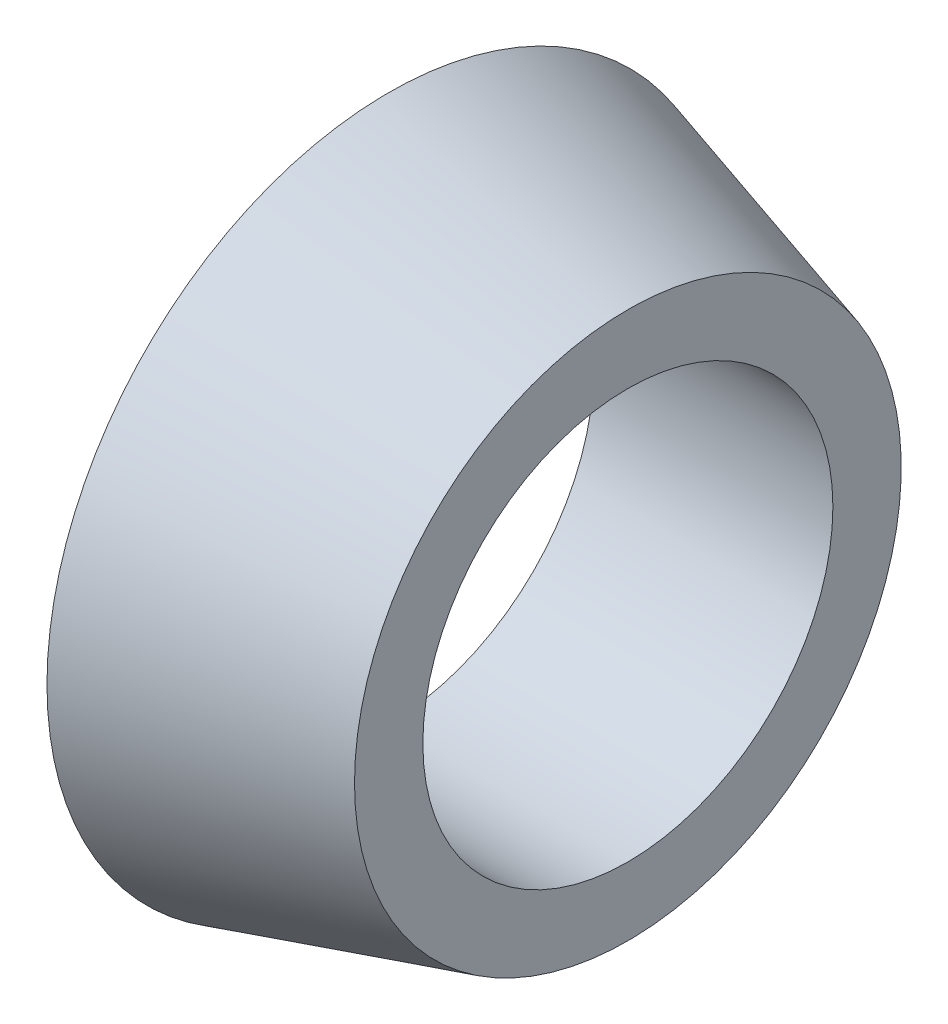
ISO-10303-21;
HEADER;
FILE_DESCRIPTION(('STEP AP214'),'2;1');
FILE_NAME('part.step','',(''),(''),'','','');
FILE_SCHEMA(('AUTOMOTIVE_DESIGN { 1 0 10303 214 1 1 1 1 }'));
ENDSEC;
DATA;
#1=APPLICATION_CONTEXT('core data for automotive mechanical design processes');
#2=APPLICATION_PROTOCOL_DEFINITION('international standard','automotive_design',2000,#1);
#3=PRODUCT_CONTEXT('',#1,'mechanical');
#4=PRODUCT('Part','Part','',(#3));
#5=PRODUCT_RELATED_PRODUCT_CATEGORY('part','',(#4));
#6=PRODUCT_DEFINITION_FORMATION('','',#4);
#7=PRODUCT_DEFINITION_CONTEXT('part definition',#1,'design');
#8=PRODUCT_DEFINITION('design','',#6,#7);
#9=PRODUCT_DEFINITION_SHAPE('','',#8);
#10=(LENGTH_UNIT() NAMED_UNIT(*) SI_UNIT(.MILLI.,.METRE.));
#11=(NAMED_UNIT(*) PLANE_ANGLE_UNIT() SI_UNIT($,.RADIAN.));
#12=(NAMED_UNIT(*) SI_UNIT($,.STERADIAN.) SOLID_ANGLE_UNIT());
#13=UNCERTAINTY_MEASURE_WITH_UNIT(LENGTH_MEASURE(1.E-05),#10,'distance_accuracy_value','');
#14=(GEOMETRIC_REPRESENTATION_CONTEXT(3) GLOBAL_UNCERTAINTY_ASSIGNED_CONTEXT((#13)) GLOBAL_UNIT_ASSIGNED_CONTEXT((#10,
#11,#12)) REPRESENTATION_CONTEXT('',''));
#15=CARTESIAN_POINT('',(0.,0.,0.));
#16=DIRECTION('',(0.,0.,1.));
#17=DIRECTION('',(1.,0.,0.));
#18=AXIS2_PLACEMENT_3D('',#15,#16,#17);
#19=CARTESIAN_POINT('',(0.,0.,0.));
#20=DIRECTION('',(-1.,0.,0.));
#21=DIRECTION('',(0.,0.,1.));
#22=AXIS2_PLACEMENT_3D('',#19,#20,#21);
#23=CYLINDRICAL_SURFACE('',#22,6.);
#24=CARTESIAN_POINT('',(7.,0.,0.));
#25=DIRECTION('',(-1.,0.,0.));
#26=DIRECTION('',(0.,0.,1.));
#27=AXIS2_PLACEMENT_3D('',#24,#25,#26);
#28=CIRCLE('',#27,6.);
#29=CARTESIAN_POINT('',(7.,0.,6.));
#30=VERTEX_POINT('',#29);
#31=EDGE_CURVE('E46',#30,#30,#28,.T.);
#32=ORIENTED_EDGE('',*,*,#31,.F.);
#33=EDGE_LOOP('',(#32));
#34=FACE_BOUND('',#33,.T.);
#35=CARTESIAN_POINT('',(0.,0.,0.));
#36=DIRECTION('',(-1.,0.,0.));
#37=DIRECTION('',(0.,0.,1.));
#38=AXIS2_PLACEMENT_3D('',#35,#36,#37);
#39=CIRCLE('',#38,6.);
#40=CARTESIAN_POINT('',(0.,0.,6.));
#41=VERTEX_POINT('',#40);
#42=EDGE_CURVE('E10',#41,#41,#39,.T.);
#43=ORIENTED_EDGE('',*,*,#42,.T.);
#44=EDGE_LOOP('',(#43));
#45=FACE_BOUND('',#44,.T.);
#46=ADVANCED_FACE('F32',(#34,#45),#23,.F.);
#47=CARTESIAN_POINT('',(0.,6.,0.));
#48=DIRECTION('',(1.,0.,0.));
#49=DIRECTION('',(0.,0.,-1.));
#50=AXIS2_PLACEMENT_3D('',#47,#48,#49);
#51=PLANE('',#50);
#52=ORIENTED_EDGE('',*,*,#42,.F.);
#53=EDGE_LOOP('',(#52));
#54=FACE_BOUND('',#53,.T.);
#55=CARTESIAN_POINT('',(0.,0.,0.));
#56=DIRECTION('',(-1.,0.,0.));
#57=DIRECTION('',(0.,0.,1.));
#58=AXIS2_PLACEMENT_3D('',#55,#56,#57);
#59=CIRCLE('',#58,10.);
#60=CARTESIAN_POINT('',(0.,0.,10.));
#61=VERTEX_POINT('',#60);
#62=EDGE_CURVE('E38',#61,#61,#59,.T.);
#63=ORIENTED_EDGE('',*,*,#62,.T.);
#64=EDGE_LOOP('',(#63));
#65=FACE_BOUND('',#64,.T.);
#66=ADVANCED_FACE('F55',(#54,#65),#51,.F.);
#67=CARTESIAN_POINT('',(7.,0.,0.));
#68=DIRECTION('',(-1.,0.,0.));
#69=DIRECTION('',(0.,0.,1.));
#70=AXIS2_PLACEMENT_3D('',#67,#68,#69);
#71=CONICAL_SURFACE('',#70,8.,0.278299659005111);
#72=ORIENTED_EDGE('',*,*,#62,.F.);
#73=EDGE_LOOP('',(#72));
#74=FACE_BOUND('',#73,.T.);
#75=CARTESIAN_POINT('',(7.,0.,0.));
#76=DIRECTION('',(-1.,0.,0.));
#77=DIRECTION('',(0.,0.,1.));
#78=AXIS2_PLACEMENT_3D('',#75,#76,#77);
#79=CIRCLE('',#78,8.);
#80=CARTESIAN_POINT('',(7.,0.,8.));
#81=VERTEX_POINT('',#80);
#82=EDGE_CURVE('E42',#81,#81,#79,.T.);
#83=ORIENTED_EDGE('',*,*,#82,.T.);
#84=EDGE_LOOP('',(#83));
#85=FACE_BOUND('',#84,.T.);
#86=ADVANCED_FACE('F59',(#74,#85),#71,.T.);
#87=CARTESIAN_POINT('',(7.,8.,0.));
#88=DIRECTION('',(-1.,0.,0.));
#89=DIRECTION('',(0.,0.,1.));
#90=AXIS2_PLACEMENT_3D('',#87,#88,#89);
#91=PLANE('',#90);
#92=ORIENTED_EDGE('',*,*,#82,.F.);
#93=EDGE_LOOP('',(#92));
#94=FACE_BOUND('',#93,.T.);
#95=ORIENTED_EDGE('',*,*,#31,.T.);
#96=EDGE_LOOP('',(#95));
#97=FACE_BOUND('',#96,.T.);
#98=ADVANCED_FACE('F52',(#94,#97),#91,.F.);
#99=CLOSED_SHELL('',(#46,#66,#86,#98));
#100=MANIFOLD_SOLID_BREP('B2',#99);
#101=ADVANCED_BREP_SHAPE_REPRESENTATION('',(#18,#100),#14);
#102=SHAPE_DEFINITION_REPRESENTATION(#9,#101);
ENDSEC;
END-ISO-10303-21;
